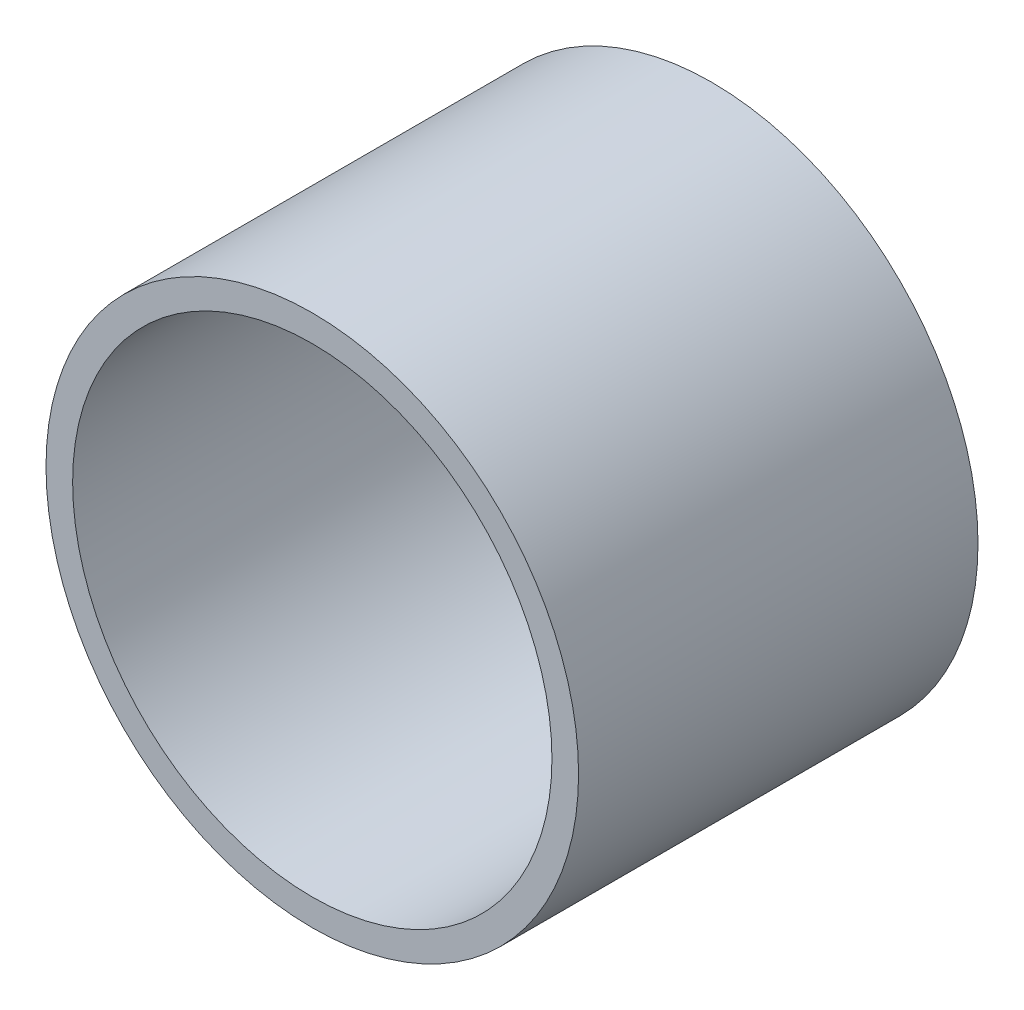
ISO-10303-21;
HEADER;
FILE_DESCRIPTION(('STEP AP214'),'2;1');
FILE_NAME('part.step','',(''),(''),'','','');
FILE_SCHEMA(('AUTOMOTIVE_DESIGN { 1 0 10303 214 1 1 1 1 }'));
ENDSEC;
DATA;
#1=APPLICATION_CONTEXT('core data for automotive mechanical design processes');
#2=APPLICATION_PROTOCOL_DEFINITION('international standard','automotive_design',2000,#1);
#3=PRODUCT_CONTEXT('',#1,'mechanical');
#4=PRODUCT('Part','Part','',(#3));
#5=PRODUCT_RELATED_PRODUCT_CATEGORY('part','',(#4));
#6=PRODUCT_DEFINITION_FORMATION('','',#4);
#7=PRODUCT_DEFINITION_CONTEXT('part definition',#1,'design');
#8=PRODUCT_DEFINITION('design','',#6,#7);
#9=PRODUCT_DEFINITION_SHAPE('','',#8);
#10=(LENGTH_UNIT() NAMED_UNIT(*) SI_UNIT(.MILLI.,.METRE.));
#11=(NAMED_UNIT(*) PLANE_ANGLE_UNIT() SI_UNIT($,.RADIAN.));
#12=(NAMED_UNIT(*) SI_UNIT($,.STERADIAN.) SOLID_ANGLE_UNIT());
#13=UNCERTAINTY_MEASURE_WITH_UNIT(LENGTH_MEASURE(1.E-05),#10,'distance_accuracy_value','');
#14=(GEOMETRIC_REPRESENTATION_CONTEXT(3) GLOBAL_UNCERTAINTY_ASSIGNED_CONTEXT((#13)) GLOBAL_UNIT_ASSIGNED_CONTEXT((#10,
#11,#12)) REPRESENTATION_CONTEXT('',''));
#15=CARTESIAN_POINT('',(0.,0.,0.));
#16=DIRECTION('',(0.,0.,1.));
#17=DIRECTION('',(1.,0.,0.));
#18=AXIS2_PLACEMENT_3D('',#15,#16,#17);
#19=CARTESIAN_POINT('',(0.,0.,6.));
#20=DIRECTION('',(0.,0.,-1.));
#21=DIRECTION('',(-1.,0.,0.));
#22=AXIS2_PLACEMENT_3D('',#19,#20,#21);
#23=CYLINDRICAL_SURFACE('',#22,3.6);
#24=CARTESIAN_POINT('',(0.,0.,0.));
#25=DIRECTION('',(0.,0.,-1.));
#26=DIRECTION('',(-1.,0.,0.));
#27=AXIS2_PLACEMENT_3D('',#24,#25,#26);
#28=CIRCLE('',#27,3.6);
#29=CARTESIAN_POINT('',(-3.6,0.,0.));
#30=VERTEX_POINT('',#29);
#31=EDGE_CURVE('E27',#30,#30,#28,.T.);
#32=ORIENTED_EDGE('',*,*,#31,.T.);
#33=EDGE_LOOP('',(#32));
#34=FACE_BOUND('',#33,.T.);
#35=CARTESIAN_POINT('',(0.,0.,6.));
#36=DIRECTION('',(0.,0.,-1.));
#37=DIRECTION('',(-1.,0.,0.));
#38=AXIS2_PLACEMENT_3D('',#35,#36,#37);
#39=CIRCLE('',#38,3.6);
#40=CARTESIAN_POINT('',(-3.6,0.,6.));
#41=VERTEX_POINT('',#40);
#42=EDGE_CURVE('E18',#41,#41,#39,.T.);
#43=ORIENTED_EDGE('',*,*,#42,.F.);
#44=EDGE_LOOP('',(#43));
#45=FACE_BOUND('',#44,.T.);
#46=ADVANCED_FACE('F15',(#34,#45),#23,.F.);
#47=CARTESIAN_POINT('',(0.,0.,6.));
#48=DIRECTION('',(0.,0.,1.));
#49=DIRECTION('',(1.,0.,0.));
#50=AXIS2_PLACEMENT_3D('',#47,#48,#49);
#51=PLANE('',#50);
#52=ORIENTED_EDGE('',*,*,#42,.T.);
#53=EDGE_LOOP('',(#52));
#54=FACE_BOUND('',#53,.T.);
#55=CARTESIAN_POINT('',(0.,0.,6.));
#56=DIRECTION('',(0.,0.,-1.));
#57=DIRECTION('',(-1.,0.,0.));
#58=AXIS2_PLACEMENT_3D('',#55,#56,#57);
#59=CIRCLE('',#58,4.);
#60=CARTESIAN_POINT('',(-4.,0.,6.));
#61=VERTEX_POINT('',#60);
#62=EDGE_CURVE('E22',#61,#61,#59,.T.);
#63=ORIENTED_EDGE('',*,*,#62,.F.);
#64=EDGE_LOOP('',(#63));
#65=FACE_BOUND('',#64,.T.);
#66=ADVANCED_FACE('F35',(#54,#65),#51,.T.);
#67=CARTESIAN_POINT('',(0.,0.,0.));
#68=DIRECTION('',(0.,0.,1.));
#69=DIRECTION('',(1.,0.,0.));
#70=AXIS2_PLACEMENT_3D('',#67,#68,#69);
#71=PLANE('',#70);
#72=ORIENTED_EDGE('',*,*,#31,.F.);
#73=EDGE_LOOP('',(#72));
#74=FACE_BOUND('',#73,.T.);
#75=CARTESIAN_POINT('',(0.,0.,0.));
#76=DIRECTION('',(0.,0.,-1.));
#77=DIRECTION('',(-1.,0.,0.));
#78=AXIS2_PLACEMENT_3D('',#75,#76,#77);
#79=CIRCLE('',#78,4.);
#80=CARTESIAN_POINT('',(-4.,0.,0.));
#81=VERTEX_POINT('',#80);
#82=EDGE_CURVE('E10',#81,#81,#79,.F.);
#83=ORIENTED_EDGE('',*,*,#82,.F.);
#84=EDGE_LOOP('',(#83));
#85=FACE_BOUND('',#84,.T.);
#86=ADVANCED_FACE('F43',(#74,#85),#71,.F.);
#87=CARTESIAN_POINT('',(0.,0.,6.));
#88=DIRECTION('',(0.,0.,-1.));
#89=DIRECTION('',(-1.,0.,0.));
#90=AXIS2_PLACEMENT_3D('',#87,#88,#89);
#91=CYLINDRICAL_SURFACE('',#90,4.);
#92=ORIENTED_EDGE('',*,*,#82,.T.);
#93=EDGE_LOOP('',(#92));
#94=FACE_BOUND('',#93,.T.);
#95=ORIENTED_EDGE('',*,*,#62,.T.);
#96=EDGE_LOOP('',(#95));
#97=FACE_BOUND('',#96,.T.);
#98=ADVANCED_FACE('F44',(#94,#97),#91,.T.);
#99=CLOSED_SHELL('',(#46,#66,#86,#98));
#100=MANIFOLD_SOLID_BREP('B1',#99);
#101=ADVANCED_BREP_SHAPE_REPRESENTATION('',(#18,#100),#14);
#102=SHAPE_DEFINITION_REPRESENTATION(#9,#101);
ENDSEC;
END-ISO-10303-21;
